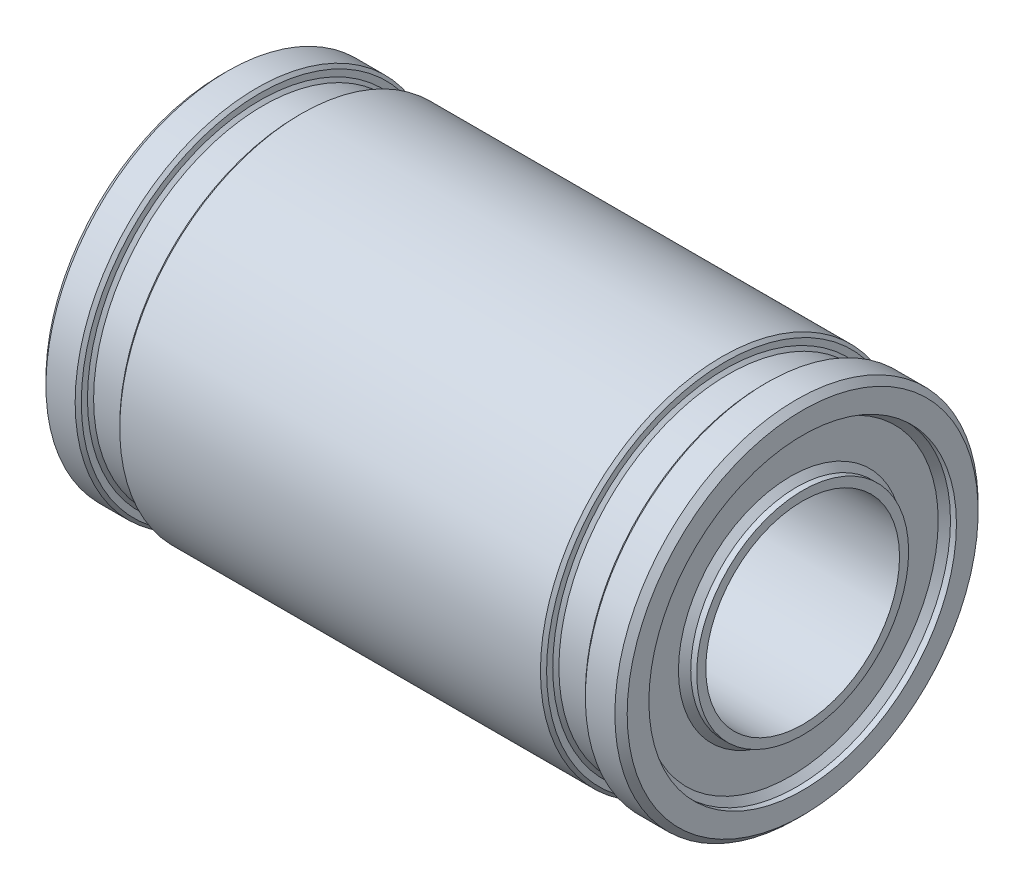
ISO-10303-21;
HEADER;
FILE_DESCRIPTION(('STEP AP214'),'2;1');
FILE_NAME('part.step','',(''),(''),'','','');
FILE_SCHEMA(('AUTOMOTIVE_DESIGN { 1 0 10303 214 1 1 1 1 }'));
ENDSEC;
DATA;
#1=APPLICATION_CONTEXT('core data for automotive mechanical design processes');
#2=APPLICATION_PROTOCOL_DEFINITION('international standard','automotive_design',2000,#1);
#3=PRODUCT_CONTEXT('',#1,'mechanical');
#4=PRODUCT('Part','Part','',(#3));
#5=PRODUCT_RELATED_PRODUCT_CATEGORY('part','',(#4));
#6=PRODUCT_DEFINITION_FORMATION('','',#4);
#7=PRODUCT_DEFINITION_CONTEXT('part definition',#1,'design');
#8=PRODUCT_DEFINITION('design','',#6,#7);
#9=PRODUCT_DEFINITION_SHAPE('','',#8);
#10=(LENGTH_UNIT() NAMED_UNIT(*) SI_UNIT(.MILLI.,.METRE.));
#11=(NAMED_UNIT(*) PLANE_ANGLE_UNIT() SI_UNIT($,.RADIAN.));
#12=(NAMED_UNIT(*) SI_UNIT($,.STERADIAN.) SOLID_ANGLE_UNIT());
#13=UNCERTAINTY_MEASURE_WITH_UNIT(LENGTH_MEASURE(1.E-05),#10,'distance_accuracy_value','');
#14=(GEOMETRIC_REPRESENTATION_CONTEXT(3) GLOBAL_UNCERTAINTY_ASSIGNED_CONTEXT((#13)) GLOBAL_UNIT_ASSIGNED_CONTEXT((#10,
#11,#12)) REPRESENTATION_CONTEXT('',''));
#15=CARTESIAN_POINT('',(0.,0.,0.));
#16=DIRECTION('',(0.,0.,1.));
#17=DIRECTION('',(1.,0.,0.));
#18=AXIS2_PLACEMENT_3D('',#15,#16,#17);
#19=CARTESIAN_POINT('',(24.,6.92500000000001,0.));
#20=DIRECTION('',(1.,0.,0.));
#21=DIRECTION('',(0.,0.,-1.));
#22=AXIS2_PLACEMENT_3D('',#19,#20,#21);
#23=PLANE('',#22);
#24=CARTESIAN_POINT('',(24.,0.,0.));
#25=DIRECTION('',(1.,0.,0.));
#26=DIRECTION('',(0.,0.,-1.));
#27=AXIS2_PLACEMENT_3D('',#24,#25,#26);
#28=CIRCLE('',#27,6.35);
#29=CARTESIAN_POINT('',(24.,0.,-6.35));
#30=VERTEX_POINT('',#29);
#31=EDGE_CURVE('E103',#30,#30,#28,.T.);
#32=ORIENTED_EDGE('',*,*,#31,.F.);
#33=EDGE_LOOP('',(#32));
#34=FACE_BOUND('',#33,.T.);
#35=CARTESIAN_POINT('',(24.0000000017015,0.,0.));
#36=DIRECTION('',(-1.,0.,0.));
#37=DIRECTION('',(0.,0.,1.));
#38=AXIS2_PLACEMENT_3D('',#35,#36,#37);
#39=CIRCLE('',#38,7.24600000170147);
#40=CARTESIAN_POINT('',(24.0000000017015,0.,7.24600000170147));
#41=VERTEX_POINT('',#40);
#42=EDGE_CURVE('E17',#41,#41,#39,.T.);
#43=ORIENTED_EDGE('',*,*,#42,.F.);
#44=EDGE_LOOP('',(#43));
#45=FACE_BOUND('',#44,.T.);
#46=ADVANCED_FACE('F14',(#34,#45),#23,.T.);
#47=CARTESIAN_POINT('',(24.0000000017015,0.,0.));
#48=DIRECTION('',(-1.,0.,0.));
#49=DIRECTION('',(0.,0.,1.));
#50=AXIS2_PLACEMENT_3D('',#47,#48,#49);
#51=CONICAL_SURFACE('',#50,7.24600000170147,0.785398150000003);
#52=ORIENTED_EDGE('',*,*,#42,.T.);
#53=EDGE_LOOP('',(#52));
#54=FACE_BOUND('',#53,.T.);
#55=CARTESIAN_POINT('',(23.746,0.,0.));
#56=DIRECTION('',(1.,0.,0.));
#57=DIRECTION('',(0.,1.,0.));
#58=AXIS2_PLACEMENT_3D('',#55,#56,#57);
#59=CIRCLE('',#58,7.5);
#60=CARTESIAN_POINT('',(23.746,7.5,0.));
#61=VERTEX_POINT('',#60);
#62=EDGE_CURVE('E98',#61,#61,#59,.F.);
#63=ORIENTED_EDGE('',*,*,#62,.F.);
#64=EDGE_LOOP('',(#63));
#65=FACE_BOUND('',#64,.T.);
#66=ADVANCED_FACE('F152',(#54,#65),#51,.T.);
#67=CARTESIAN_POINT('',(23.754,0.,0.));
#68=DIRECTION('',(1.,0.,0.));
#69=DIRECTION('',(0.,0.,-1.));
#70=AXIS2_PLACEMENT_3D('',#67,#68,#69);
#71=CYLINDRICAL_SURFACE('',#70,6.35);
#72=CARTESIAN_POINT('',(23.754,0.,0.));
#73=DIRECTION('',(1.,0.,0.));
#74=DIRECTION('',(0.,-1.,0.));
#75=AXIS2_PLACEMENT_3D('',#72,#73,#74);
#76=CIRCLE('',#75,6.35);
#77=CARTESIAN_POINT('',(23.754,-6.35,0.));
#78=VERTEX_POINT('',#77);
#79=EDGE_CURVE('E93',#78,#78,#76,.T.);
#80=ORIENTED_EDGE('',*,*,#79,.F.);
#81=EDGE_LOOP('',(#80));
#82=FACE_BOUND('',#81,.T.);
#83=ORIENTED_EDGE('',*,*,#31,.T.);
#84=EDGE_LOOP('',(#83));
#85=FACE_BOUND('',#84,.T.);
#86=ADVANCED_FACE('F161',(#82,#85),#71,.F.);
#87=CARTESIAN_POINT('',(22.5268,0.,0.));
#88=DIRECTION('',(1.,0.,0.));
#89=DIRECTION('',(0.,0.,-1.));
#90=AXIS2_PLACEMENT_3D('',#87,#88,#89);
#91=CYLINDRICAL_SURFACE('',#90,7.5);
#92=CARTESIAN_POINT('',(22.5268000008508,0.,0.));
#93=DIRECTION('',(1.,0.,0.));
#94=DIRECTION('',(0.,-1.,0.));
#95=AXIS2_PLACEMENT_3D('',#92,#93,#94);
#96=CIRCLE('',#95,7.49999999914926);
#97=CARTESIAN_POINT('',(22.5268000008508,-7.49999999914926,0.));
#98=VERTEX_POINT('',#97);
#99=EDGE_CURVE('E89',#98,#98,#96,.F.);
#100=ORIENTED_EDGE('',*,*,#99,.F.);
#101=EDGE_LOOP('',(#100));
#102=FACE_BOUND('',#101,.T.);
#103=ORIENTED_EDGE('',*,*,#62,.T.);
#104=EDGE_LOOP('',(#103));
#105=FACE_BOUND('',#104,.T.);
#106=ADVANCED_FACE('F284',(#102,#105),#91,.T.);
#107=CARTESIAN_POINT('',(23.5,0.,0.));
#108=DIRECTION('',(1.,0.,0.));
#109=DIRECTION('',(0.,0.,-1.));
#110=AXIS2_PLACEMENT_3D('',#107,#108,#109);
#111=CONICAL_SURFACE('',#110,6.096,0.785398163397453);
#112=CARTESIAN_POINT('',(23.5,0.,0.));
#113=DIRECTION('',(1.,0.,0.));
#114=DIRECTION('',(0.,0.,-1.));
#115=AXIS2_PLACEMENT_3D('',#112,#113,#114);
#116=CIRCLE('',#115,6.096);
#117=CARTESIAN_POINT('',(23.5,0.,-6.096));
#118=VERTEX_POINT('',#117);
#119=EDGE_CURVE('E92',#118,#118,#116,.T.);
#120=ORIENTED_EDGE('',*,*,#119,.F.);
#121=EDGE_LOOP('',(#120));
#122=FACE_BOUND('',#121,.T.);
#123=ORIENTED_EDGE('',*,*,#79,.T.);
#124=EDGE_LOOP('',(#123));
#125=FACE_BOUND('',#124,.T.);
#126=ADVANCED_FACE('F280',(#122,#125),#111,.F.);
#127=CARTESIAN_POINT('',(22.3997999991493,0.,0.));
#128=DIRECTION('',(1.,0.,0.));
#129=DIRECTION('',(0.,0.,-1.));
#130=AXIS2_PLACEMENT_3D('',#127,#128,#129);
#131=CONICAL_SURFACE('',#130,7.37300000085074,0.785398149999998);
#132=ORIENTED_EDGE('',*,*,#99,.T.);
#133=EDGE_LOOP('',(#132));
#134=FACE_BOUND('',#133,.T.);
#135=CARTESIAN_POINT('',(22.3997999991493,0.,0.));
#136=DIRECTION('',(1.,0.,0.));
#137=DIRECTION('',(0.,0.,-1.));
#138=AXIS2_PLACEMENT_3D('',#135,#136,#137);
#139=CIRCLE('',#138,7.37300000085074);
#140=CARTESIAN_POINT('',(22.3997999991493,0.,-7.37300000085074));
#141=VERTEX_POINT('',#140);
#142=EDGE_CURVE('E142',#141,#141,#139,.F.);
#143=ORIENTED_EDGE('',*,*,#142,.F.);
#144=EDGE_LOOP('',(#143));
#145=FACE_BOUND('',#144,.T.);
#146=ADVANCED_FACE('F276',(#134,#145),#131,.T.);
#147=CARTESIAN_POINT('',(23.5,5.36274966431095,0.));
#148=DIRECTION('',(1.,0.,0.));
#149=DIRECTION('',(0.,0.,-1.));
#150=AXIS2_PLACEMENT_3D('',#147,#148,#149);
#151=PLANE('',#150);
#152=CARTESIAN_POINT('',(23.4999999982985,0.,0.));
#153=DIRECTION('',(-1.,0.,0.));
#154=DIRECTION('',(0.,0.,1.));
#155=AXIS2_PLACEMENT_3D('',#152,#153,#154);
#156=CIRCLE('',#155,4.62949932692042);
#157=CARTESIAN_POINT('',(23.4999999982985,0.,4.62949932692042));
#158=VERTEX_POINT('',#157);
#159=EDGE_CURVE('E139',#158,#158,#156,.F.);
#160=ORIENTED_EDGE('',*,*,#159,.F.);
#161=EDGE_LOOP('',(#160));
#162=FACE_BOUND('',#161,.T.);
#163=ORIENTED_EDGE('',*,*,#119,.T.);
#164=EDGE_LOOP('',(#163));
#165=FACE_BOUND('',#164,.T.);
#166=ADVANCED_FACE('F272',(#162,#165),#151,.T.);
#167=CARTESIAN_POINT('',(22.3998,7.246,0.));
#168=DIRECTION('',(-1.,0.,0.));
#169=DIRECTION('',(0.,0.,1.));
#170=AXIS2_PLACEMENT_3D('',#167,#168,#169);
#171=PLANE('',#170);
#172=CARTESIAN_POINT('',(22.3998000008508,0.,0.));
#173=DIRECTION('',(1.,0.,0.));
#174=DIRECTION('',(0.,0.,-1.));
#175=AXIS2_PLACEMENT_3D('',#172,#173,#174);
#176=CIRCLE('',#175,7.11899999914926);
#177=CARTESIAN_POINT('',(22.3998000008508,0.,-7.11899999914926));
#178=VERTEX_POINT('',#177);
#179=EDGE_CURVE('E86',#178,#178,#176,.F.);
#180=ORIENTED_EDGE('',*,*,#179,.F.);
#181=EDGE_LOOP('',(#180));
#182=FACE_BOUND('',#181,.T.);
#183=ORIENTED_EDGE('',*,*,#142,.T.);
#184=EDGE_LOOP('',(#183));
#185=FACE_BOUND('',#184,.T.);
#186=ADVANCED_FACE('F268',(#182,#185),#171,.T.);
#187=CARTESIAN_POINT('',(23.7540000017015,0.,0.));
#188=DIRECTION('',(-1.,0.,0.));
#189=DIRECTION('',(0.,0.,1.));
#190=AXIS2_PLACEMENT_3D('',#187,#188,#189);
#191=CONICAL_SURFACE('',#190,4.37549933032337,0.785398150000001);
#192=CARTESIAN_POINT('',(23.754,0.,0.));
#193=DIRECTION('',(1.,0.,0.));
#194=DIRECTION('',(0.,1.,0.));
#195=AXIS2_PLACEMENT_3D('',#192,#193,#194);
#196=CIRCLE('',#195,4.37549932862189);
#197=CARTESIAN_POINT('',(23.754,4.37549932862189,0.));
#198=VERTEX_POINT('',#197);
#199=EDGE_CURVE('E81',#198,#198,#196,.T.);
#200=ORIENTED_EDGE('',*,*,#199,.F.);
#201=EDGE_LOOP('',(#200));
#202=FACE_BOUND('',#201,.T.);
#203=ORIENTED_EDGE('',*,*,#159,.T.);
#204=EDGE_LOOP('',(#203));
#205=FACE_BOUND('',#204,.T.);
#206=ADVANCED_FACE('F264',(#202,#205),#191,.T.);
#207=CARTESIAN_POINT('',(22.2727999991493,0.,0.));
#208=DIRECTION('',(1.,0.,0.));
#209=DIRECTION('',(0.,0.,-1.));
#210=AXIS2_PLACEMENT_3D('',#207,#208,#209);
#211=CONICAL_SURFACE('',#210,6.99200000085074,0.785398150000001);
#212=ORIENTED_EDGE('',*,*,#179,.T.);
#213=EDGE_LOOP('',(#212));
#214=FACE_BOUND('',#213,.T.);
#215=CARTESIAN_POINT('',(22.2728,0.,0.));
#216=DIRECTION('',(1.,0.,0.));
#217=DIRECTION('',(0.,1.,0.));
#218=AXIS2_PLACEMENT_3D('',#215,#216,#217);
#219=CIRCLE('',#218,6.992);
#220=CARTESIAN_POINT('',(22.2728,6.992,0.));
#221=VERTEX_POINT('',#220);
#222=EDGE_CURVE('E78',#221,#221,#219,.F.);
#223=ORIENTED_EDGE('',*,*,#222,.F.);
#224=EDGE_LOOP('',(#223));
#225=FACE_BOUND('',#224,.T.);
#226=ADVANCED_FACE('F260',(#214,#225),#211,.T.);
#227=CARTESIAN_POINT('',(23.754,0.,0.));
#228=DIRECTION('',(1.,0.,0.));
#229=DIRECTION('',(0.,0.,-1.));
#230=AXIS2_PLACEMENT_3D('',#227,#228,#229);
#231=CYLINDRICAL_SURFACE('',#230,4.37549932862189);
#232=ORIENTED_EDGE('',*,*,#199,.T.);
#233=EDGE_LOOP('',(#232));
#234=FACE_BOUND('',#233,.T.);
#235=CARTESIAN_POINT('',(24.,0.,0.));
#236=DIRECTION('',(1.,0.,0.));
#237=DIRECTION('',(0.,0.,-1.));
#238=AXIS2_PLACEMENT_3D('',#235,#236,#237);
#239=CIRCLE('',#238,4.37549932862189);
#240=CARTESIAN_POINT('',(24.,0.,-4.37549932862189));
#241=VERTEX_POINT('',#240);
#242=EDGE_CURVE('E75',#241,#241,#239,.T.);
#243=ORIENTED_EDGE('',*,*,#242,.F.);
#244=EDGE_LOOP('',(#243));
#245=FACE_BOUND('',#244,.T.);
#246=ADVANCED_FACE('F256',(#234,#245),#231,.T.);
#247=CARTESIAN_POINT('',(20.9266,0.,0.));
#248=DIRECTION('',(1.,0.,0.));
#249=DIRECTION('',(0.,0.,-1.));
#250=AXIS2_PLACEMENT_3D('',#247,#248,#249);
#251=CYLINDRICAL_SURFACE('',#250,6.992);
#252=CARTESIAN_POINT('',(20.9266000008508,0.,0.));
#253=DIRECTION('',(-1.,0.,0.));
#254=DIRECTION('',(0.,-1.,0.));
#255=AXIS2_PLACEMENT_3D('',#252,#253,#254);
#256=CIRCLE('',#255,6.99200000085073);
#257=CARTESIAN_POINT('',(20.9266000008508,-6.99200000085073,0.));
#258=VERTEX_POINT('',#257);
#259=EDGE_CURVE('E71',#258,#258,#256,.T.);
#260=ORIENTED_EDGE('',*,*,#259,.F.);
#261=EDGE_LOOP('',(#260));
#262=FACE_BOUND('',#261,.T.);
#263=ORIENTED_EDGE('',*,*,#222,.T.);
#264=EDGE_LOOP('',(#263));
#265=FACE_BOUND('',#264,.T.);
#266=ADVANCED_FACE('F252',(#262,#265),#251,.T.);
#267=CARTESIAN_POINT('',(24.,4.18774966431095,0.));
#268=DIRECTION('',(1.,0.,0.));
#269=DIRECTION('',(0.,0.,-1.));
#270=AXIS2_PLACEMENT_3D('',#267,#268,#269);
#271=PLANE('',#270);
#272=CARTESIAN_POINT('',(24.,0.,0.));
#273=DIRECTION('',(1.,0.,0.));
#274=DIRECTION('',(0.,0.,-1.));
#275=AXIS2_PLACEMENT_3D('',#272,#273,#274);
#276=CIRCLE('',#275,4.);
#277=CARTESIAN_POINT('',(24.,0.,-4.));
#278=VERTEX_POINT('',#277);
#279=EDGE_CURVE('E74',#278,#278,#276,.T.);
#280=ORIENTED_EDGE('',*,*,#279,.F.);
#281=EDGE_LOOP('',(#280));
#282=FACE_BOUND('',#281,.T.);
#283=ORIENTED_EDGE('',*,*,#242,.T.);
#284=EDGE_LOOP('',(#283));
#285=FACE_BOUND('',#284,.T.);
#286=ADVANCED_FACE('F248',(#282,#285),#271,.T.);
#287=CARTESIAN_POINT('',(20.9266000008508,0.,0.));
#288=DIRECTION('',(-1.,0.,0.));
#289=DIRECTION('',(0.,0.,1.));
#290=AXIS2_PLACEMENT_3D('',#287,#288,#289);
#291=CONICAL_SURFACE('',#290,6.99200000085073,0.785398149999991);
#292=ORIENTED_EDGE('',*,*,#259,.T.);
#293=EDGE_LOOP('',(#292));
#294=FACE_BOUND('',#293,.T.);
#295=CARTESIAN_POINT('',(20.7995999991493,0.,0.));
#296=DIRECTION('',(-1.,0.,0.));
#297=DIRECTION('',(0.,0.,1.));
#298=AXIS2_PLACEMENT_3D('',#295,#296,#297);
#299=CIRCLE('',#298,7.11899999914926);
#300=CARTESIAN_POINT('',(20.7995999991493,0.,7.11899999914926));
#301=VERTEX_POINT('',#300);
#302=EDGE_CURVE('E130',#301,#301,#299,.T.);
#303=ORIENTED_EDGE('',*,*,#302,.F.);
#304=EDGE_LOOP('',(#303));
#305=FACE_BOUND('',#304,.T.);
#306=ADVANCED_FACE('F244',(#294,#305),#291,.T.);
#307=CARTESIAN_POINT('',(0.,0.,0.));
#308=DIRECTION('',(1.,0.,0.));
#309=DIRECTION('',(0.,0.,-1.));
#310=AXIS2_PLACEMENT_3D('',#307,#308,#309);
#311=CYLINDRICAL_SURFACE('',#310,4.);
#312=ORIENTED_EDGE('',*,*,#279,.T.);
#313=EDGE_LOOP('',(#312));
#314=FACE_BOUND('',#313,.T.);
#315=CARTESIAN_POINT('',(0.,0.,0.));
#316=DIRECTION('',(1.,0.,0.));
#317=DIRECTION('',(0.,0.,-1.));
#318=AXIS2_PLACEMENT_3D('',#315,#316,#317);
#319=CIRCLE('',#318,4.);
#320=CARTESIAN_POINT('',(0.,0.,-4.));
#321=VERTEX_POINT('',#320);
#322=EDGE_CURVE('E127',#321,#321,#319,.T.);
#323=ORIENTED_EDGE('',*,*,#322,.F.);
#324=EDGE_LOOP('',(#323));
#325=FACE_BOUND('',#324,.T.);
#326=ADVANCED_FACE('F240',(#314,#325),#311,.F.);
#327=CARTESIAN_POINT('',(20.7996,7.246,0.));
#328=DIRECTION('',(1.,0.,0.));
#329=DIRECTION('',(0.,0.,-1.));
#330=AXIS2_PLACEMENT_3D('',#327,#328,#329);
#331=PLANE('',#330);
#332=ORIENTED_EDGE('',*,*,#302,.T.);
#333=EDGE_LOOP('',(#332));
#334=FACE_BOUND('',#333,.T.);
#335=CARTESIAN_POINT('',(20.7996000008508,0.,0.));
#336=DIRECTION('',(-1.,0.,0.));
#337=DIRECTION('',(0.,0.,1.));
#338=AXIS2_PLACEMENT_3D('',#335,#336,#337);
#339=CIRCLE('',#338,7.37300000085074);
#340=CARTESIAN_POINT('',(20.7996000008508,0.,7.37300000085074));
#341=VERTEX_POINT('',#340);
#342=EDGE_CURVE('E124',#341,#341,#339,.T.);
#343=ORIENTED_EDGE('',*,*,#342,.F.);
#344=EDGE_LOOP('',(#343));
#345=FACE_BOUND('',#344,.T.);
#346=ADVANCED_FACE('F236',(#334,#345),#331,.T.);
#347=CARTESIAN_POINT('',(0.,4.18774966431095,0.));
#348=DIRECTION('',(-1.,0.,0.));
#349=DIRECTION('',(0.,0.,1.));
#350=AXIS2_PLACEMENT_3D('',#347,#348,#349);
#351=PLANE('',#350);
#352=ORIENTED_EDGE('',*,*,#322,.T.);
#353=EDGE_LOOP('',(#352));
#354=FACE_BOUND('',#353,.T.);
#355=CARTESIAN_POINT('',(0.,0.,0.));
#356=DIRECTION('',(1.,0.,0.));
#357=DIRECTION('',(0.,0.,-1.));
#358=AXIS2_PLACEMENT_3D('',#355,#356,#357);
#359=CIRCLE('',#358,4.37549932862189);
#360=CARTESIAN_POINT('',(0.,0.,-4.37549932862189));
#361=VERTEX_POINT('',#360);
#362=EDGE_CURVE('E68',#361,#361,#359,.T.);
#363=ORIENTED_EDGE('',*,*,#362,.F.);
#364=EDGE_LOOP('',(#363));
#365=FACE_BOUND('',#364,.T.);
#366=ADVANCED_FACE('F232',(#354,#365),#351,.T.);
#367=CARTESIAN_POINT('',(20.7996000008508,0.,0.));
#368=DIRECTION('',(-1.,0.,0.));
#369=DIRECTION('',(0.,0.,1.));
#370=AXIS2_PLACEMENT_3D('',#367,#368,#369);
#371=CONICAL_SURFACE('',#370,7.37300000085074,0.785398149999994);
#372=ORIENTED_EDGE('',*,*,#342,.T.);
#373=EDGE_LOOP('',(#372));
#374=FACE_BOUND('',#373,.T.);
#375=CARTESIAN_POINT('',(20.6726,0.,0.));
#376=DIRECTION('',(1.,0.,0.));
#377=DIRECTION('',(0.,1.,0.));
#378=AXIS2_PLACEMENT_3D('',#375,#376,#377);
#379=CIRCLE('',#378,7.5);
#380=CARTESIAN_POINT('',(20.6726,7.5,0.));
#381=VERTEX_POINT('',#380);
#382=EDGE_CURVE('E63',#381,#381,#379,.F.);
#383=ORIENTED_EDGE('',*,*,#382,.F.);
#384=EDGE_LOOP('',(#383));
#385=FACE_BOUND('',#384,.T.);
#386=ADVANCED_FACE('F228',(#374,#385),#371,.T.);
#387=CARTESIAN_POINT('',(0.,0.,0.));
#388=DIRECTION('',(1.,0.,0.));
#389=DIRECTION('',(0.,0.,-1.));
#390=AXIS2_PLACEMENT_3D('',#387,#388,#389);
#391=CYLINDRICAL_SURFACE('',#390,4.37549932862189);
#392=CARTESIAN_POINT('',(0.256329418975003,0.,0.));
#393=DIRECTION('',(1.,0.,0.));
#394=DIRECTION('',(0.,-1.,0.));
#395=AXIS2_PLACEMENT_3D('',#392,#393,#394);
#396=CIRCLE('',#395,4.37549933032337);
#397=CARTESIAN_POINT('',(0.256329418975003,-4.37549933032337,0.));
#398=VERTEX_POINT('',#397);
#399=EDGE_CURVE('E58',#398,#398,#396,.T.);
#400=ORIENTED_EDGE('',*,*,#399,.F.);
#401=EDGE_LOOP('',(#400));
#402=FACE_BOUND('',#401,.T.);
#403=ORIENTED_EDGE('',*,*,#362,.T.);
#404=EDGE_LOOP('',(#403));
#405=FACE_BOUND('',#404,.T.);
#406=ADVANCED_FACE('F224',(#402,#405),#391,.T.);
#407=CARTESIAN_POINT('',(3.302,0.,0.));
#408=DIRECTION('',(1.,0.,0.));
#409=DIRECTION('',(0.,0.,-1.));
#410=AXIS2_PLACEMENT_3D('',#407,#408,#409);
#411=CYLINDRICAL_SURFACE('',#410,7.5);
#412=ORIENTED_EDGE('',*,*,#382,.T.);
#413=EDGE_LOOP('',(#412));
#414=FACE_BOUND('',#413,.T.);
#415=CARTESIAN_POINT('',(3.30200000085074,0.,0.));
#416=DIRECTION('',(1.,0.,0.));
#417=DIRECTION('',(0.,-1.,0.));
#418=AXIS2_PLACEMENT_3D('',#415,#416,#417);
#419=CIRCLE('',#418,7.49999999914926);
#420=CARTESIAN_POINT('',(3.30200000085074,-7.49999999914926,0.));
#421=VERTEX_POINT('',#420);
#422=EDGE_CURVE('E54',#421,#421,#419,.F.);
#423=ORIENTED_EDGE('',*,*,#422,.F.);
#424=EDGE_LOOP('',(#423));
#425=FACE_BOUND('',#424,.T.);
#426=ADVANCED_FACE('F220',(#414,#425),#411,.T.);
#427=CARTESIAN_POINT('',(0.256329418975004,0.,0.));
#428=DIRECTION('',(1.,0.,0.));
#429=DIRECTION('',(0.,0.,-1.));
#430=AXIS2_PLACEMENT_3D('',#427,#428,#429);
#431=CONICAL_SURFACE('',#430,4.37549933032337,0.78539815);
#432=CARTESIAN_POINT('',(0.510329422377955,0.,0.));
#433=DIRECTION('',(1.,0.,0.));
#434=DIRECTION('',(0.,0.,-1.));
#435=AXIS2_PLACEMENT_3D('',#432,#433,#434);
#436=CIRCLE('',#435,4.62949932692042);
#437=CARTESIAN_POINT('',(0.510329422377955,0.,-4.62949932692042));
#438=VERTEX_POINT('',#437);
#439=EDGE_CURVE('E57',#438,#438,#436,.T.);
#440=ORIENTED_EDGE('',*,*,#439,.F.);
#441=EDGE_LOOP('',(#440));
#442=FACE_BOUND('',#441,.T.);
#443=ORIENTED_EDGE('',*,*,#399,.T.);
#444=EDGE_LOOP('',(#443));
#445=FACE_BOUND('',#444,.T.);
#446=ADVANCED_FACE('F216',(#442,#445),#431,.T.);
#447=CARTESIAN_POINT('',(3.17499999914926,0.,0.));
#448=DIRECTION('',(1.,0.,0.));
#449=DIRECTION('',(0.,0.,-1.));
#450=AXIS2_PLACEMENT_3D('',#447,#448,#449);
#451=CONICAL_SURFACE('',#450,7.37300000085074,0.785398149999998);
#452=ORIENTED_EDGE('',*,*,#422,.T.);
#453=EDGE_LOOP('',(#452));
#454=FACE_BOUND('',#453,.T.);
#455=CARTESIAN_POINT('',(3.17499999914926,0.,0.));
#456=DIRECTION('',(1.,0.,0.));
#457=DIRECTION('',(0.,0.,-1.));
#458=AXIS2_PLACEMENT_3D('',#455,#456,#457);
#459=CIRCLE('',#458,7.37300000085074);
#460=CARTESIAN_POINT('',(3.17499999914926,0.,-7.37300000085074));
#461=VERTEX_POINT('',#460);
#462=EDGE_CURVE('E117',#461,#461,#459,.F.);
#463=ORIENTED_EDGE('',*,*,#462,.F.);
#464=EDGE_LOOP('',(#463));
#465=FACE_BOUND('',#464,.T.);
#466=ADVANCED_FACE('F212',(#454,#465),#451,.T.);
#467=CARTESIAN_POINT('',(0.510329420676478,5.36274966431095,0.));
#468=DIRECTION('',(-1.,0.,0.));
#469=DIRECTION('',(0.,0.,1.));
#470=AXIS2_PLACEMENT_3D('',#467,#468,#469);
#471=PLANE('',#470);
#472=ORIENTED_EDGE('',*,*,#439,.T.);
#473=EDGE_LOOP('',(#472));
#474=FACE_BOUND('',#473,.T.);
#475=CARTESIAN_POINT('',(0.510329420676478,0.,0.));
#476=DIRECTION('',(-1.,0.,0.));
#477=DIRECTION('',(0.,0.,1.));
#478=AXIS2_PLACEMENT_3D('',#475,#476,#477);
#479=CIRCLE('',#478,6.096);
#480=CARTESIAN_POINT('',(0.510329420676478,0.,6.096));
#481=VERTEX_POINT('',#480);
#482=EDGE_CURVE('E114',#481,#481,#479,.F.);
#483=ORIENTED_EDGE('',*,*,#482,.F.);
#484=EDGE_LOOP('',(#483));
#485=FACE_BOUND('',#484,.T.);
#486=ADVANCED_FACE('F208',(#474,#485),#471,.T.);
#487=CARTESIAN_POINT('',(3.175,7.246,0.));
#488=DIRECTION('',(-1.,0.,0.));
#489=DIRECTION('',(0.,0.,1.));
#490=AXIS2_PLACEMENT_3D('',#487,#488,#489);
#491=PLANE('',#490);
#492=CARTESIAN_POINT('',(3.17500000085074,0.,0.));
#493=DIRECTION('',(1.,0.,0.));
#494=DIRECTION('',(0.,0.,-1.));
#495=AXIS2_PLACEMENT_3D('',#492,#493,#494);
#496=CIRCLE('',#495,7.11899999914926);
#497=CARTESIAN_POINT('',(3.17500000085074,0.,-7.11899999914926));
#498=VERTEX_POINT('',#497);
#499=EDGE_CURVE('E51',#498,#498,#496,.F.);
#500=ORIENTED_EDGE('',*,*,#499,.F.);
#501=EDGE_LOOP('',(#500));
#502=FACE_BOUND('',#501,.T.);
#503=ORIENTED_EDGE('',*,*,#462,.T.);
#504=EDGE_LOOP('',(#503));
#505=FACE_BOUND('',#504,.T.);
#506=ADVANCED_FACE('F204',(#502,#505),#491,.T.);
#507=CARTESIAN_POINT('',(0.510329420676478,0.,0.));
#508=DIRECTION('',(-1.,0.,0.));
#509=DIRECTION('',(0.,0.,1.));
#510=AXIS2_PLACEMENT_3D('',#507,#508,#509);
#511=CONICAL_SURFACE('',#510,6.096,0.785398163397449);
#512=CARTESIAN_POINT('',(0.256329420676478,0.,0.));
#513=DIRECTION('',(1.,0.,0.));
#514=DIRECTION('',(0.,1.,0.));
#515=AXIS2_PLACEMENT_3D('',#512,#513,#514);
#516=CIRCLE('',#515,6.35);
#517=CARTESIAN_POINT('',(0.256329420676478,6.35,0.));
#518=VERTEX_POINT('',#517);
#519=EDGE_CURVE('E46',#518,#518,#516,.T.);
#520=ORIENTED_EDGE('',*,*,#519,.F.);
#521=EDGE_LOOP('',(#520));
#522=FACE_BOUND('',#521,.T.);
#523=ORIENTED_EDGE('',*,*,#482,.T.);
#524=EDGE_LOOP('',(#523));
#525=FACE_BOUND('',#524,.T.);
#526=ADVANCED_FACE('F200',(#522,#525),#511,.F.);
#527=CARTESIAN_POINT('',(3.04799999914927,0.,0.));
#528=DIRECTION('',(1.,0.,0.));
#529=DIRECTION('',(0.,0.,-1.));
#530=AXIS2_PLACEMENT_3D('',#527,#528,#529);
#531=CONICAL_SURFACE('',#530,6.99200000085074,0.785398150000001);
#532=ORIENTED_EDGE('',*,*,#499,.T.);
#533=EDGE_LOOP('',(#532));
#534=FACE_BOUND('',#533,.T.);
#535=CARTESIAN_POINT('',(3.048,0.,0.));
#536=DIRECTION('',(1.,0.,0.));
#537=DIRECTION('',(0.,1.,0.));
#538=AXIS2_PLACEMENT_3D('',#535,#536,#537);
#539=CIRCLE('',#538,6.992);
#540=CARTESIAN_POINT('',(3.048,6.992,0.));
#541=VERTEX_POINT('',#540);
#542=EDGE_CURVE('E43',#541,#541,#539,.F.);
#543=ORIENTED_EDGE('',*,*,#542,.F.);
#544=EDGE_LOOP('',(#543));
#545=FACE_BOUND('',#544,.T.);
#546=ADVANCED_FACE('F196',(#534,#545),#531,.T.);
#547=CARTESIAN_POINT('',(0.,0.,0.));
#548=DIRECTION('',(1.,0.,0.));
#549=DIRECTION('',(0.,0.,-1.));
#550=AXIS2_PLACEMENT_3D('',#547,#548,#549);
#551=CYLINDRICAL_SURFACE('',#550,6.35);
#552=ORIENTED_EDGE('',*,*,#519,.T.);
#553=EDGE_LOOP('',(#552));
#554=FACE_BOUND('',#553,.T.);
#555=CARTESIAN_POINT('',(0.,0.,0.));
#556=DIRECTION('',(1.,0.,0.));
#557=DIRECTION('',(0.,0.,-1.));
#558=AXIS2_PLACEMENT_3D('',#555,#556,#557);
#559=CIRCLE('',#558,6.35);
#560=CARTESIAN_POINT('',(0.,0.,-6.35));
#561=VERTEX_POINT('',#560);
#562=EDGE_CURVE('E40',#561,#561,#559,.T.);
#563=ORIENTED_EDGE('',*,*,#562,.F.);
#564=EDGE_LOOP('',(#563));
#565=FACE_BOUND('',#564,.T.);
#566=ADVANCED_FACE('F192',(#554,#565),#551,.F.);
#567=CARTESIAN_POINT('',(1.7145,0.,0.));
#568=DIRECTION('',(1.,0.,0.));
#569=DIRECTION('',(0.,0.,-1.));
#570=AXIS2_PLACEMENT_3D('',#567,#568,#569);
#571=CYLINDRICAL_SURFACE('',#570,6.992);
#572=CARTESIAN_POINT('',(1.71450000085074,0.,0.));
#573=DIRECTION('',(-1.,0.,0.));
#574=DIRECTION('',(0.,-1.,0.));
#575=AXIS2_PLACEMENT_3D('',#572,#573,#574);
#576=CIRCLE('',#575,6.99200000085073);
#577=CARTESIAN_POINT('',(1.71450000085074,-6.99200000085073,0.));
#578=VERTEX_POINT('',#577);
#579=EDGE_CURVE('E36',#578,#578,#576,.T.);
#580=ORIENTED_EDGE('',*,*,#579,.F.);
#581=EDGE_LOOP('',(#580));
#582=FACE_BOUND('',#581,.T.);
#583=ORIENTED_EDGE('',*,*,#542,.T.);
#584=EDGE_LOOP('',(#583));
#585=FACE_BOUND('',#584,.T.);
#586=ADVANCED_FACE('F188',(#582,#585),#571,.T.);
#587=CARTESIAN_POINT('',(0.,6.92500000000001,0.));
#588=DIRECTION('',(-1.,0.,0.));
#589=DIRECTION('',(0.,0.,1.));
#590=AXIS2_PLACEMENT_3D('',#587,#588,#589);
#591=PLANE('',#590);
#592=ORIENTED_EDGE('',*,*,#562,.T.);
#593=EDGE_LOOP('',(#592));
#594=FACE_BOUND('',#593,.T.);
#595=CARTESIAN_POINT('',(-1.70147576583624E-09,0.,0.));
#596=DIRECTION('',(1.,0.,0.));
#597=DIRECTION('',(0.,0.,-1.));
#598=AXIS2_PLACEMENT_3D('',#595,#596,#597);
#599=CIRCLE('',#598,7.24600000170147);
#600=CARTESIAN_POINT('',(-1.70147576583624E-09,0.,-7.24600000170147));
#601=VERTEX_POINT('',#600);
#602=EDGE_CURVE('E39',#601,#601,#599,.T.);
#603=ORIENTED_EDGE('',*,*,#602,.F.);
#604=EDGE_LOOP('',(#603));
#605=FACE_BOUND('',#604,.T.);
#606=ADVANCED_FACE('F184',(#594,#605),#591,.T.);
#607=CARTESIAN_POINT('',(1.71450000085074,0.,0.));
#608=DIRECTION('',(-1.,0.,0.));
#609=DIRECTION('',(0.,0.,1.));
#610=AXIS2_PLACEMENT_3D('',#607,#608,#609);
#611=CONICAL_SURFACE('',#610,6.99200000085074,0.785398150000001);
#612=ORIENTED_EDGE('',*,*,#579,.T.);
#613=EDGE_LOOP('',(#612));
#614=FACE_BOUND('',#613,.T.);
#615=CARTESIAN_POINT('',(1.58749999914926,0.,0.));
#616=DIRECTION('',(-1.,0.,0.));
#617=DIRECTION('',(0.,0.,1.));
#618=AXIS2_PLACEMENT_3D('',#615,#616,#617);
#619=CIRCLE('',#618,7.11899999914926);
#620=CARTESIAN_POINT('',(1.58749999914926,0.,7.11899999914926));
#621=VERTEX_POINT('',#620);
#622=EDGE_CURVE('E33',#621,#621,#619,.T.);
#623=ORIENTED_EDGE('',*,*,#622,.F.);
#624=EDGE_LOOP('',(#623));
#625=FACE_BOUND('',#624,.T.);
#626=ADVANCED_FACE('F180',(#614,#625),#611,.T.);
#627=CARTESIAN_POINT('',(-1.70147576583624E-09,0.,0.));
#628=DIRECTION('',(1.,0.,0.));
#629=DIRECTION('',(0.,0.,-1.));
#630=AXIS2_PLACEMENT_3D('',#627,#628,#629);
#631=CONICAL_SURFACE('',#630,7.24600000170147,0.78539815);
#632=CARTESIAN_POINT('',(0.254000000000001,0.,0.));
#633=DIRECTION('',(1.,0.,0.));
#634=DIRECTION('',(0.,1.,0.));
#635=AXIS2_PLACEMENT_3D('',#632,#633,#634);
#636=CIRCLE('',#635,7.5);
#637=CARTESIAN_POINT('',(0.254000000000001,7.5,0.));
#638=VERTEX_POINT('',#637);
#639=EDGE_CURVE('E26',#638,#638,#636,.T.);
#640=ORIENTED_EDGE('',*,*,#639,.F.);
#641=EDGE_LOOP('',(#640));
#642=FACE_BOUND('',#641,.T.);
#643=ORIENTED_EDGE('',*,*,#602,.T.);
#644=EDGE_LOOP('',(#643));
#645=FACE_BOUND('',#644,.T.);
#646=ADVANCED_FACE('F176',(#642,#645),#631,.T.);
#647=CARTESIAN_POINT('',(1.5875,7.246,0.));
#648=DIRECTION('',(1.,0.,0.));
#649=DIRECTION('',(0.,0.,-1.));
#650=AXIS2_PLACEMENT_3D('',#647,#648,#649);
#651=PLANE('',#650);
#652=ORIENTED_EDGE('',*,*,#622,.T.);
#653=EDGE_LOOP('',(#652));
#654=FACE_BOUND('',#653,.T.);
#655=CARTESIAN_POINT('',(1.58750000085074,0.,0.));
#656=DIRECTION('',(-1.,0.,0.));
#657=DIRECTION('',(0.,0.,1.));
#658=AXIS2_PLACEMENT_3D('',#655,#656,#657);
#659=CIRCLE('',#658,7.37300000085073);
#660=CARTESIAN_POINT('',(1.58750000085074,0.,7.37300000085073));
#661=VERTEX_POINT('',#660);
#662=EDGE_CURVE('E21',#661,#661,#659,.T.);
#663=ORIENTED_EDGE('',*,*,#662,.F.);
#664=EDGE_LOOP('',(#663));
#665=FACE_BOUND('',#664,.T.);
#666=ADVANCED_FACE('F169',(#654,#665),#651,.T.);
#667=CARTESIAN_POINT('',(0.254000000000001,0.,0.));
#668=DIRECTION('',(1.,0.,0.));
#669=DIRECTION('',(0.,0.,-1.));
#670=AXIS2_PLACEMENT_3D('',#667,#668,#669);
#671=CYLINDRICAL_SURFACE('',#670,7.5);
#672=CARTESIAN_POINT('',(1.46049999914926,0.,0.));
#673=DIRECTION('',(-1.,0.,0.));
#674=DIRECTION('',(0.,-1.,0.));
#675=AXIS2_PLACEMENT_3D('',#672,#673,#674);
#676=CIRCLE('',#675,7.49999999914926);
#677=CARTESIAN_POINT('',(1.46049999914926,-7.49999999914926,0.));
#678=VERTEX_POINT('',#677);
#679=EDGE_CURVE('E10',#678,#678,#676,.F.);
#680=ORIENTED_EDGE('',*,*,#679,.F.);
#681=EDGE_LOOP('',(#680));
#682=FACE_BOUND('',#681,.T.);
#683=ORIENTED_EDGE('',*,*,#639,.T.);
#684=EDGE_LOOP('',(#683));
#685=FACE_BOUND('',#684,.T.);
#686=ADVANCED_FACE('F164',(#682,#685),#671,.T.);
#687=CARTESIAN_POINT('',(1.58750000085074,0.,0.));
#688=DIRECTION('',(-1.,0.,0.));
#689=DIRECTION('',(0.,0.,1.));
#690=AXIS2_PLACEMENT_3D('',#687,#688,#689);
#691=CONICAL_SURFACE('',#690,7.37300000085074,0.785398150000001);
#692=ORIENTED_EDGE('',*,*,#679,.T.);
#693=EDGE_LOOP('',(#692));
#694=FACE_BOUND('',#693,.T.);
#695=ORIENTED_EDGE('',*,*,#662,.T.);
#696=EDGE_LOOP('',(#695));
#697=FACE_BOUND('',#696,.T.);
#698=ADVANCED_FACE('F162',(#694,#697),#691,.T.);
#699=CLOSED_SHELL('',(#46,#66,#86,#106,#126,#146,#166,#186,#206,#226,#246,#266,#286,#306,#326,
#346,#366,#386,#406,#426,#446,#466,#486,#506,#526,#546,#566,#586,#606,#626,#646,#666,#686,#698));
#700=MANIFOLD_SOLID_BREP('B1',#699);
#701=ADVANCED_BREP_SHAPE_REPRESENTATION('',(#18,#700),#14);
#702=SHAPE_DEFINITION_REPRESENTATION(#9,#701);
ENDSEC;
END-ISO-10303-21;
